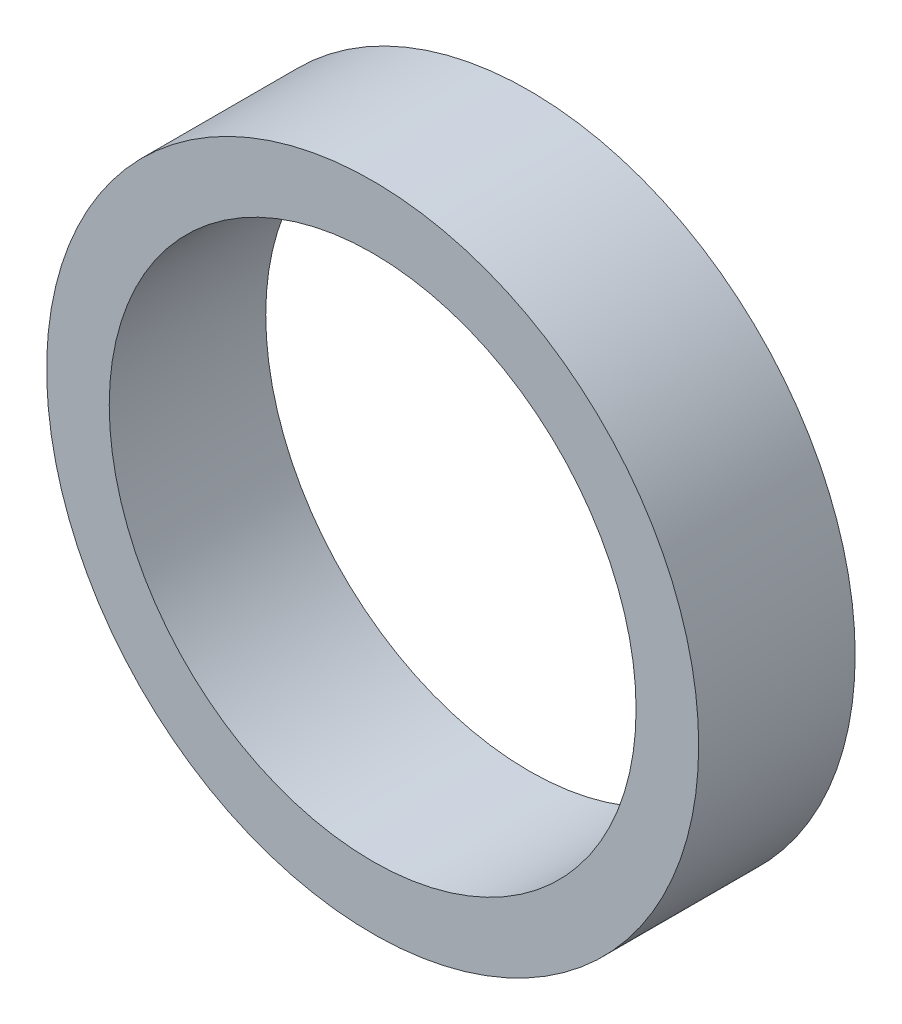
ISO-10303-21;
HEADER;
FILE_DESCRIPTION(('STEP AP214'),'2;1');
FILE_NAME('part.step','',(''),(''),'','','');
FILE_SCHEMA(('AUTOMOTIVE_DESIGN { 1 0 10303 214 1 1 1 1 }'));
ENDSEC;
DATA;
#1=APPLICATION_CONTEXT('core data for automotive mechanical design processes');
#2=APPLICATION_PROTOCOL_DEFINITION('international standard','automotive_design',2000,#1);
#3=PRODUCT_CONTEXT('',#1,'mechanical');
#4=PRODUCT('Part','Part','',(#3));
#5=PRODUCT_RELATED_PRODUCT_CATEGORY('part','',(#4));
#6=PRODUCT_DEFINITION_FORMATION('','',#4);
#7=PRODUCT_DEFINITION_CONTEXT('part definition',#1,'design');
#8=PRODUCT_DEFINITION('design','',#6,#7);
#9=PRODUCT_DEFINITION_SHAPE('','',#8);
#10=(LENGTH_UNIT() NAMED_UNIT(*) SI_UNIT(.MILLI.,.METRE.));
#11=(NAMED_UNIT(*) PLANE_ANGLE_UNIT() SI_UNIT($,.RADIAN.));
#12=(NAMED_UNIT(*) SI_UNIT($,.STERADIAN.) SOLID_ANGLE_UNIT());
#13=UNCERTAINTY_MEASURE_WITH_UNIT(LENGTH_MEASURE(1.E-05),#10,'distance_accuracy_value','');
#14=(GEOMETRIC_REPRESENTATION_CONTEXT(3) GLOBAL_UNCERTAINTY_ASSIGNED_CONTEXT((#13)) GLOBAL_UNIT_ASSIGNED_CONTEXT((#10,
#11,#12)) REPRESENTATION_CONTEXT('',''));
#15=CARTESIAN_POINT('',(0.,0.,0.));
#16=DIRECTION('',(0.,0.,1.));
#17=DIRECTION('',(1.,0.,0.));
#18=AXIS2_PLACEMENT_3D('',#15,#16,#17);
#19=CARTESIAN_POINT('',(0.,0.,0.36));
#20=DIRECTION('',(0.,0.,1.));
#21=DIRECTION('',(1.,0.,0.));
#22=AXIS2_PLACEMENT_3D('',#19,#20,#21);
#23=PLANE('',#22);
#24=CARTESIAN_POINT('',(0.,0.,0.36));
#25=DIRECTION('',(0.,0.,1.));
#26=DIRECTION('',(1.,0.,0.));
#27=AXIS2_PLACEMENT_3D('',#24,#25,#26);
#28=CIRCLE('',#27,0.75);
#29=CARTESIAN_POINT('',(0.75,0.,0.36));
#30=VERTEX_POINT('',#29);
#31=EDGE_CURVE('E10',#30,#30,#28,.T.);
#32=ORIENTED_EDGE('',*,*,#31,.T.);
#33=EDGE_LOOP('',(#32));
#34=FACE_BOUND('',#33,.T.);
#35=CARTESIAN_POINT('',(0.,0.,0.36));
#36=DIRECTION('',(0.,0.,1.));
#37=DIRECTION('',(1.,0.,0.));
#38=AXIS2_PLACEMENT_3D('',#35,#36,#37);
#39=CIRCLE('',#38,0.606);
#40=CARTESIAN_POINT('',(0.606,0.,0.36));
#41=VERTEX_POINT('',#40);
#42=EDGE_CURVE('E48',#41,#41,#39,.T.);
#43=ORIENTED_EDGE('',*,*,#42,.F.);
#44=EDGE_LOOP('',(#43));
#45=FACE_BOUND('',#44,.T.);
#46=ADVANCED_FACE('F37',(#34,#45),#23,.T.);
#47=CARTESIAN_POINT('',(0.,0.,0.));
#48=DIRECTION('',(0.,0.,1.));
#49=DIRECTION('',(1.,0.,0.));
#50=AXIS2_PLACEMENT_3D('',#47,#48,#49);
#51=PLANE('',#50);
#52=CARTESIAN_POINT('',(0.,0.,0.));
#53=DIRECTION('',(0.,0.,1.));
#54=DIRECTION('',(1.,0.,0.));
#55=AXIS2_PLACEMENT_3D('',#52,#53,#54);
#56=CIRCLE('',#55,0.75);
#57=CARTESIAN_POINT('',(0.75,0.,0.));
#58=VERTEX_POINT('',#57);
#59=EDGE_CURVE('E41',#58,#58,#56,.T.);
#60=ORIENTED_EDGE('',*,*,#59,.F.);
#61=EDGE_LOOP('',(#60));
#62=FACE_BOUND('',#61,.T.);
#63=CARTESIAN_POINT('',(0.,0.,0.));
#64=DIRECTION('',(0.,0.,1.));
#65=DIRECTION('',(1.,0.,0.));
#66=AXIS2_PLACEMENT_3D('',#63,#64,#65);
#67=CIRCLE('',#66,0.606);
#68=CARTESIAN_POINT('',(0.606,0.,0.));
#69=VERTEX_POINT('',#68);
#70=EDGE_CURVE('E50',#69,#69,#67,.T.);
#71=ORIENTED_EDGE('',*,*,#70,.T.);
#72=EDGE_LOOP('',(#71));
#73=FACE_BOUND('',#72,.T.);
#74=ADVANCED_FACE('F60',(#62,#73),#51,.F.);
#75=CARTESIAN_POINT('',(0.,0.,0.36));
#76=DIRECTION('',(0.,0.,-1.));
#77=DIRECTION('',(-1.,0.,0.));
#78=AXIS2_PLACEMENT_3D('',#75,#76,#77);
#79=CYLINDRICAL_SURFACE('',#78,0.75);
#80=ORIENTED_EDGE('',*,*,#31,.F.);
#81=EDGE_LOOP('',(#80));
#82=FACE_BOUND('',#81,.T.);
#83=ORIENTED_EDGE('',*,*,#59,.T.);
#84=EDGE_LOOP('',(#83));
#85=FACE_BOUND('',#84,.T.);
#86=ADVANCED_FACE('F39',(#82,#85),#79,.T.);
#87=CARTESIAN_POINT('',(0.,0.,0.36));
#88=DIRECTION('',(0.,0.,-1.));
#89=DIRECTION('',(-1.,0.,0.));
#90=AXIS2_PLACEMENT_3D('',#87,#88,#89);
#91=CYLINDRICAL_SURFACE('',#90,0.606);
#92=ORIENTED_EDGE('',*,*,#42,.T.);
#93=EDGE_LOOP('',(#92));
#94=FACE_BOUND('',#93,.T.);
#95=ORIENTED_EDGE('',*,*,#70,.F.);
#96=EDGE_LOOP('',(#95));
#97=FACE_BOUND('',#96,.T.);
#98=ADVANCED_FACE('F56',(#94,#97),#91,.F.);
#99=CLOSED_SHELL('',(#46,#74,#86,#98));
#100=MANIFOLD_SOLID_BREP('B2',#99);
#101=ADVANCED_BREP_SHAPE_REPRESENTATION('',(#18,#100),#14);
#102=SHAPE_DEFINITION_REPRESENTATION(#9,#101);
ENDSEC;
END-ISO-10303-21;
